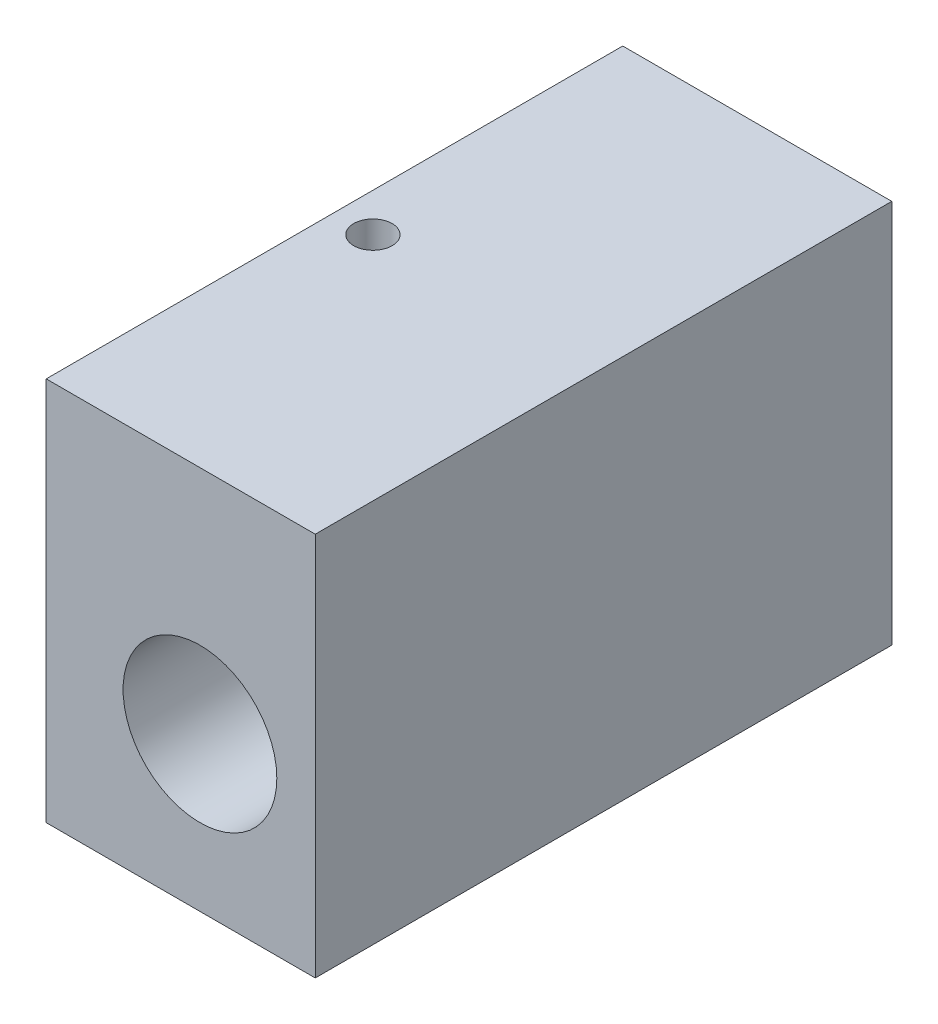
ISO-10303-21;
HEADER;
FILE_DESCRIPTION(('STEP AP214'),'2;1');
FILE_NAME('part.step','',(''),(''),'','','');
FILE_SCHEMA(('AUTOMOTIVE_DESIGN { 1 0 10303 214 1 1 1 1 }'));
ENDSEC;
DATA;
#1=APPLICATION_CONTEXT('core data for automotive mechanical design processes');
#2=APPLICATION_PROTOCOL_DEFINITION('international standard','automotive_design',2000,#1);
#3=PRODUCT_CONTEXT('',#1,'mechanical');
#4=PRODUCT('Part','Part','',(#3));
#5=PRODUCT_RELATED_PRODUCT_CATEGORY('part','',(#4));
#6=PRODUCT_DEFINITION_FORMATION('','',#4);
#7=PRODUCT_DEFINITION_CONTEXT('part definition',#1,'design');
#8=PRODUCT_DEFINITION('design','',#6,#7);
#9=PRODUCT_DEFINITION_SHAPE('','',#8);
#10=(LENGTH_UNIT() NAMED_UNIT(*) SI_UNIT(.MILLI.,.METRE.));
#11=(NAMED_UNIT(*) PLANE_ANGLE_UNIT() SI_UNIT($,.RADIAN.));
#12=(NAMED_UNIT(*) SI_UNIT($,.STERADIAN.) SOLID_ANGLE_UNIT());
#13=UNCERTAINTY_MEASURE_WITH_UNIT(LENGTH_MEASURE(1.E-05),#10,'distance_accuracy_value','');
#14=(GEOMETRIC_REPRESENTATION_CONTEXT(3) GLOBAL_UNCERTAINTY_ASSIGNED_CONTEXT((#13)) GLOBAL_UNIT_ASSIGNED_CONTEXT((#10,
#11,#12)) REPRESENTATION_CONTEXT('',''));
#15=CARTESIAN_POINT('',(0.,0.,0.));
#16=DIRECTION('',(0.,0.,1.));
#17=DIRECTION('',(1.,0.,0.));
#18=AXIS2_PLACEMENT_3D('',#15,#16,#17);
#19=CARTESIAN_POINT('',(0.,10.,0.));
#20=DIRECTION('',(1.,0.,0.));
#21=DIRECTION('',(0.,0.,-1.));
#22=AXIS2_PLACEMENT_3D('',#19,#20,#21);
#23=PLANE('',#22);
#24=DIRECTION('',(0.,0.,1.));
#25=VECTOR('',#24,1.);
#26=CARTESIAN_POINT('',(0.,0.,0.));
#27=LINE('',#26,#25);
#28=CARTESIAN_POINT('',(0.,0.,-15.));
#29=VERTEX_POINT('',#28);
#30=CARTESIAN_POINT('',(0.,0.,0.));
#31=VERTEX_POINT('',#30);
#32=EDGE_CURVE('E100',#29,#31,#27,.T.);
#33=ORIENTED_EDGE('',*,*,#32,.T.);
#34=DIRECTION('',(0.,-1.,0.));
#35=VECTOR('',#34,1.);
#36=CARTESIAN_POINT('',(0.,10.,0.));
#37=LINE('',#36,#35);
#38=CARTESIAN_POINT('',(0.,10.,0.));
#39=VERTEX_POINT('',#38);
#40=EDGE_CURVE('E11',#39,#31,#37,.T.);
#41=ORIENTED_EDGE('',*,*,#40,.F.);
#42=DIRECTION('',(0.,0.,1.));
#43=VECTOR('',#42,1.);
#44=CARTESIAN_POINT('',(0.,10.,0.));
#45=LINE('',#44,#43);
#46=CARTESIAN_POINT('',(0.,10.,-15.));
#47=VERTEX_POINT('',#46);
#48=EDGE_CURVE('E88',#47,#39,#45,.T.);
#49=ORIENTED_EDGE('',*,*,#48,.F.);
#50=DIRECTION('',(0.,-1.,0.));
#51=VECTOR('',#50,1.);
#52=CARTESIAN_POINT('',(0.,10.,-15.));
#53=LINE('',#52,#51);
#54=EDGE_CURVE('E96',#47,#29,#53,.T.);
#55=ORIENTED_EDGE('',*,*,#54,.T.);
#56=EDGE_LOOP('',(#33,#41,#49,#55));
#57=FACE_BOUND('',#56,.T.);
#58=ADVANCED_FACE('F37',(#57),#23,.F.);
#59=CARTESIAN_POINT('',(0.,10.,0.));
#60=DIRECTION('',(0.,0.,-1.));
#61=DIRECTION('',(-1.,0.,0.));
#62=AXIS2_PLACEMENT_3D('',#59,#60,#61);
#63=PLANE('',#62);
#64=CARTESIAN_POINT('',(4.,4.,0.));
#65=DIRECTION('',(0.,0.,1.));
#66=DIRECTION('',(1.,0.,0.));
#67=AXIS2_PLACEMENT_3D('',#64,#65,#66);
#68=CIRCLE('',#67,2.);
#69=CARTESIAN_POINT('',(6.,4.,0.));
#70=VERTEX_POINT('',#69);
#71=EDGE_CURVE('E114',#70,#70,#68,.T.);
#72=ORIENTED_EDGE('',*,*,#71,.F.);
#73=EDGE_LOOP('',(#72));
#74=FACE_BOUND('',#73,.T.);
#75=DIRECTION('',(1.,0.,0.));
#76=VECTOR('',#75,1.);
#77=CARTESIAN_POINT('',(0.,0.,0.));
#78=LINE('',#77,#76);
#79=CARTESIAN_POINT('',(7.,0.,0.));
#80=VERTEX_POINT('',#79);
#81=EDGE_CURVE('E92',#31,#80,#78,.T.);
#82=ORIENTED_EDGE('',*,*,#81,.T.);
#83=DIRECTION('',(0.,-1.,0.));
#84=VECTOR('',#83,1.);
#85=CARTESIAN_POINT('',(7.,10.,0.));
#86=LINE('',#85,#84);
#87=CARTESIAN_POINT('',(7.,10.,0.));
#88=VERTEX_POINT('',#87);
#89=EDGE_CURVE('E45',#88,#80,#86,.T.);
#90=ORIENTED_EDGE('',*,*,#89,.F.);
#91=DIRECTION('',(1.,0.,0.));
#92=VECTOR('',#91,1.);
#93=CARTESIAN_POINT('',(0.,10.,0.));
#94=LINE('',#93,#92);
#95=EDGE_CURVE('E83',#39,#88,#94,.T.);
#96=ORIENTED_EDGE('',*,*,#95,.F.);
#97=ORIENTED_EDGE('',*,*,#40,.T.);
#98=EDGE_LOOP('',(#82,#90,#96,#97));
#99=FACE_BOUND('',#98,.T.);
#100=ADVANCED_FACE('F91',(#74,#99),#63,.F.);
#101=CARTESIAN_POINT('',(7.,10.,0.));
#102=DIRECTION('',(-1.,0.,0.));
#103=DIRECTION('',(0.,0.,1.));
#104=AXIS2_PLACEMENT_3D('',#101,#102,#103);
#105=PLANE('',#104);
#106=DIRECTION('',(0.,0.,-1.));
#107=VECTOR('',#106,1.);
#108=CARTESIAN_POINT('',(7.,0.,0.));
#109=LINE('',#108,#107);
#110=CARTESIAN_POINT('',(7.,0.,-15.));
#111=VERTEX_POINT('',#110);
#112=EDGE_CURVE('E70',#80,#111,#109,.T.);
#113=ORIENTED_EDGE('',*,*,#112,.T.);
#114=DIRECTION('',(0.,-1.,0.));
#115=VECTOR('',#114,1.);
#116=CARTESIAN_POINT('',(7.,10.,-15.));
#117=LINE('',#116,#115);
#118=CARTESIAN_POINT('',(7.,10.,-15.));
#119=VERTEX_POINT('',#118);
#120=EDGE_CURVE('E93',#119,#111,#117,.T.);
#121=ORIENTED_EDGE('',*,*,#120,.F.);
#122=DIRECTION('',(0.,0.,-1.));
#123=VECTOR('',#122,1.);
#124=CARTESIAN_POINT('',(7.,10.,0.));
#125=LINE('',#124,#123);
#126=EDGE_CURVE('E86',#88,#119,#125,.T.);
#127=ORIENTED_EDGE('',*,*,#126,.F.);
#128=ORIENTED_EDGE('',*,*,#89,.T.);
#129=EDGE_LOOP('',(#113,#121,#127,#128));
#130=FACE_BOUND('',#129,.T.);
#131=ADVANCED_FACE('F94',(#130),#105,.F.);
#132=CARTESIAN_POINT('',(0.,10.,-15.));
#133=DIRECTION('',(0.,0.,1.));
#134=DIRECTION('',(1.,0.,0.));
#135=AXIS2_PLACEMENT_3D('',#132,#133,#134);
#136=PLANE('',#135);
#137=CARTESIAN_POINT('',(4.,4.,-15.));
#138=DIRECTION('',(0.,0.,1.));
#139=DIRECTION('',(1.,0.,0.));
#140=AXIS2_PLACEMENT_3D('',#137,#138,#139);
#141=CIRCLE('',#140,2.);
#142=CARTESIAN_POINT('',(6.,4.,-15.));
#143=VERTEX_POINT('',#142);
#144=EDGE_CURVE('E103',#143,#143,#141,.T.);
#145=ORIENTED_EDGE('',*,*,#144,.T.);
#146=EDGE_LOOP('',(#145));
#147=FACE_BOUND('',#146,.T.);
#148=DIRECTION('',(-1.,0.,0.));
#149=VECTOR('',#148,1.);
#150=CARTESIAN_POINT('',(0.,0.,-15.));
#151=LINE('',#150,#149);
#152=EDGE_CURVE('E76',#111,#29,#151,.T.);
#153=ORIENTED_EDGE('',*,*,#152,.T.);
#154=ORIENTED_EDGE('',*,*,#54,.F.);
#155=DIRECTION('',(-1.,0.,0.));
#156=VECTOR('',#155,1.);
#157=CARTESIAN_POINT('',(0.,10.,-15.));
#158=LINE('',#157,#156);
#159=EDGE_CURVE('E53',#119,#47,#158,.T.);
#160=ORIENTED_EDGE('',*,*,#159,.F.);
#161=ORIENTED_EDGE('',*,*,#120,.T.);
#162=EDGE_LOOP('',(#153,#154,#160,#161));
#163=FACE_BOUND('',#162,.T.);
#164=ADVANCED_FACE('F108',(#147,#163),#136,.F.);
#165=CARTESIAN_POINT('',(0.,10.,0.));
#166=DIRECTION('',(0.,-1.,0.));
#167=DIRECTION('',(0.,0.,-1.));
#168=AXIS2_PLACEMENT_3D('',#165,#166,#167);
#169=PLANE('',#168);
#170=CARTESIAN_POINT('',(1.,10.,-7.5));
#171=DIRECTION('',(0.,1.,0.));
#172=DIRECTION('',(0.,0.,1.));
#173=AXIS2_PLACEMENT_3D('',#170,#171,#172);
#174=CIRCLE('',#173,0.5);
#175=CARTESIAN_POINT('',(1.,10.,-7.));
#176=VERTEX_POINT('',#175);
#177=EDGE_CURVE('E120',#176,#176,#174,.T.);
#178=ORIENTED_EDGE('',*,*,#177,.F.);
#179=EDGE_LOOP('',(#178));
#180=FACE_BOUND('',#179,.T.);
#181=ORIENTED_EDGE('',*,*,#48,.T.);
#182=ORIENTED_EDGE('',*,*,#95,.T.);
#183=ORIENTED_EDGE('',*,*,#126,.T.);
#184=ORIENTED_EDGE('',*,*,#159,.T.);
#185=EDGE_LOOP('',(#181,#182,#183,#184));
#186=FACE_BOUND('',#185,.T.);
#187=ADVANCED_FACE('F84',(#180,#186),#169,.F.);
#188=CARTESIAN_POINT('',(0.,0.,0.));
#189=DIRECTION('',(0.,-1.,0.));
#190=DIRECTION('',(0.,0.,-1.));
#191=AXIS2_PLACEMENT_3D('',#188,#189,#190);
#192=PLANE('',#191);
#193=ORIENTED_EDGE('',*,*,#32,.F.);
#194=ORIENTED_EDGE('',*,*,#152,.F.);
#195=ORIENTED_EDGE('',*,*,#112,.F.);
#196=ORIENTED_EDGE('',*,*,#81,.F.);
#197=EDGE_LOOP('',(#193,#194,#195,#196));
#198=FACE_BOUND('',#197,.T.);
#199=ADVANCED_FACE('F111',(#198),#192,.T.);
#200=CARTESIAN_POINT('',(4.,4.,-15.));
#201=DIRECTION('',(0.,0.,1.));
#202=DIRECTION('',(1.,0.,0.));
#203=AXIS2_PLACEMENT_3D('',#200,#201,#202);
#204=CYLINDRICAL_SURFACE('',#203,2.);
#205=ORIENTED_EDGE('',*,*,#144,.F.);
#206=EDGE_LOOP('',(#205));
#207=FACE_BOUND('',#206,.T.);
#208=ORIENTED_EDGE('',*,*,#71,.T.);
#209=EDGE_LOOP('',(#208));
#210=FACE_BOUND('',#209,.T.);
#211=ADVANCED_FACE('F131',(#207,#210),#204,.F.);
#212=CARTESIAN_POINT('',(1.,2.,-7.5));
#213=DIRECTION('',(0.,1.,0.));
#214=DIRECTION('',(0.,0.,1.));
#215=AXIS2_PLACEMENT_3D('',#212,#213,#214);
#216=CYLINDRICAL_SURFACE('',#215,0.5);
#217=CARTESIAN_POINT('',(1.,2.,-7.5));
#218=DIRECTION('',(0.,1.,0.));
#219=DIRECTION('',(0.,0.,1.));
#220=AXIS2_PLACEMENT_3D('',#217,#218,#219);
#221=CIRCLE('',#220,0.5);
#222=CARTESIAN_POINT('',(1.,2.,-7.));
#223=VERTEX_POINT('',#222);
#224=EDGE_CURVE('E117',#223,#223,#221,.T.);
#225=ORIENTED_EDGE('',*,*,#224,.F.);
#226=EDGE_LOOP('',(#225));
#227=FACE_BOUND('',#226,.T.);
#228=ORIENTED_EDGE('',*,*,#177,.T.);
#229=EDGE_LOOP('',(#228));
#230=FACE_BOUND('',#229,.T.);
#231=ADVANCED_FACE('F128',(#227,#230),#216,.F.);
#232=CARTESIAN_POINT('',(1.,2.,-7.5));
#233=DIRECTION('',(0.,1.,0.));
#234=DIRECTION('',(0.,0.,1.));
#235=AXIS2_PLACEMENT_3D('',#232,#233,#234);
#236=PLANE('',#235);
#237=ORIENTED_EDGE('',*,*,#224,.T.);
#238=EDGE_LOOP('',(#237));
#239=FACE_BOUND('',#238,.T.);
#240=ADVANCED_FACE('F126',(#239),#236,.T.);
#241=CLOSED_SHELL('',(#58,#100,#131,#164,#187,#199,#211,#231,#240));
#242=MANIFOLD_SOLID_BREP('B2',#241);
#243=ADVANCED_BREP_SHAPE_REPRESENTATION('',(#18,#242),#14);
#244=SHAPE_DEFINITION_REPRESENTATION(#9,#243);
ENDSEC;
END-ISO-10303-21;
